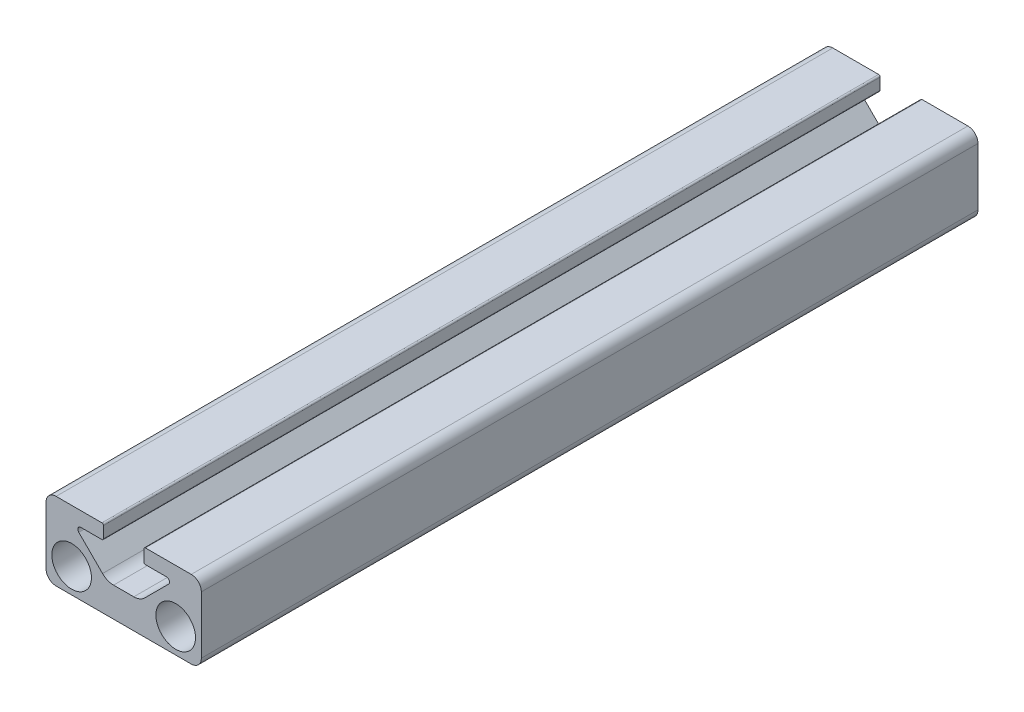
ISO-10303-21;
HEADER;
FILE_DESCRIPTION(('STEP AP214'),'2;1');
FILE_NAME('part.step','',(''),(''),'','','');
FILE_SCHEMA(('AUTOMOTIVE_DESIGN { 1 0 10303 214 1 1 1 1 }'));
ENDSEC;
DATA;
#1=APPLICATION_CONTEXT('core data for automotive mechanical design processes');
#2=APPLICATION_PROTOCOL_DEFINITION('international standard','automotive_design',2000,#1);
#3=PRODUCT_CONTEXT('',#1,'mechanical');
#4=PRODUCT('Part','Part','',(#3));
#5=PRODUCT_RELATED_PRODUCT_CATEGORY('part','',(#4));
#6=PRODUCT_DEFINITION_FORMATION('','',#4);
#7=PRODUCT_DEFINITION_CONTEXT('part definition',#1,'design');
#8=PRODUCT_DEFINITION('design','',#6,#7);
#9=PRODUCT_DEFINITION_SHAPE('','',#8);
#10=(LENGTH_UNIT() NAMED_UNIT(*) SI_UNIT(.MILLI.,.METRE.));
#11=(NAMED_UNIT(*) PLANE_ANGLE_UNIT() SI_UNIT($,.RADIAN.));
#12=(NAMED_UNIT(*) SI_UNIT($,.STERADIAN.) SOLID_ANGLE_UNIT());
#13=UNCERTAINTY_MEASURE_WITH_UNIT(LENGTH_MEASURE(1.E-05),#10,'distance_accuracy_value','');
#14=(GEOMETRIC_REPRESENTATION_CONTEXT(3) GLOBAL_UNCERTAINTY_ASSIGNED_CONTEXT((#13)) GLOBAL_UNIT_ASSIGNED_CONTEXT((#10,
#11,#12)) REPRESENTATION_CONTEXT('',''));
#15=CARTESIAN_POINT('',(0.,0.,0.));
#16=DIRECTION('',(0.,0.,1.));
#17=DIRECTION('',(1.,0.,0.));
#18=AXIS2_PLACEMENT_3D('',#15,#16,#17);
#19=CARTESIAN_POINT('',(-11.049,11.049,63.5));
#20=DIRECTION('',(0.,0.,1.));
#21=DIRECTION('',(1.,0.,0.));
#22=AXIS2_PLACEMENT_3D('',#19,#20,#21);
#23=PLANE('',#22);
#24=CARTESIAN_POINT('',(8.509,4.064,63.5));
#25=DIRECTION('',(0.,0.,1.));
#26=DIRECTION('',(1.,0.,0.));
#27=AXIS2_PLACEMENT_3D('',#24,#25,#26);
#28=CIRCLE('',#27,3.2385);
#29=CARTESIAN_POINT('',(11.7475,4.064,63.5));
#30=VERTEX_POINT('',#29);
#31=EDGE_CURVE('E513',#30,#30,#28,.T.);
#32=ORIENTED_EDGE('',*,*,#31,.F.);
#33=EDGE_LOOP('',(#32));
#34=FACE_BOUND('',#33,.T.);
#35=DIRECTION('',(0.,-1.,0.));
#36=VECTOR('',#35,1.);
#37=CARTESIAN_POINT('',(3.302,12.7,63.5));
#38=LINE('',#37,#36);
#39=CARTESIAN_POINT('',(3.302,12.446,63.5));
#40=VERTEX_POINT('',#39);
#41=CARTESIAN_POINT('',(3.302,10.582863886556,63.5));
#42=VERTEX_POINT('',#41);
#43=EDGE_CURVE('E480',#40,#42,#38,.T.);
#44=ORIENTED_EDGE('',*,*,#43,.T.);
#45=CARTESIAN_POINT('',(3.556,10.582863886556,63.5));
#46=DIRECTION('',(0.,0.,1.));
#47=DIRECTION('',(1.,0.,0.));
#48=AXIS2_PLACEMENT_3D('',#45,#46,#47);
#49=CIRCLE('',#48,0.254);
#50=CARTESIAN_POINT('',(3.556,10.328863886556,63.5));
#51=VERTEX_POINT('',#50);
#52=EDGE_CURVE('E269',#42,#51,#49,.T.);
#53=ORIENTED_EDGE('',*,*,#52,.T.);
#54=DIRECTION('',(1.,0.,0.));
#55=VECTOR('',#54,1.);
#56=CARTESIAN_POINT('',(3.302,10.328863886556,63.5));
#57=LINE('',#56,#55);
#58=CARTESIAN_POINT('',(6.985,10.328863886556,63.5));
#59=VERTEX_POINT('',#58);
#60=EDGE_CURVE('E472',#51,#59,#57,.T.);
#61=ORIENTED_EDGE('',*,*,#60,.T.);
#62=CARTESIAN_POINT('',(6.985,9.82086388655604,63.5));
#63=DIRECTION('',(0.,0.,-1.));
#64=DIRECTION('',(1.,0.,0.));
#65=AXIS2_PLACEMENT_3D('',#62,#63,#64);
#66=CIRCLE('',#65,0.508);
#67=CARTESIAN_POINT('',(7.34421024484277,9.46165364171327,63.5));
#68=VERTEX_POINT('',#67);
#69=EDGE_CURVE('E465',#59,#68,#66,.T.);
#70=ORIENTED_EDGE('',*,*,#69,.T.);
#71=DIRECTION('',(-0.707106781186546,-0.707106781186549,0.));
#72=VECTOR('',#71,1.);
#73=CARTESIAN_POINT('',(7.34421024484277,9.46165364171327,63.5));
#74=LINE('',#73,#72);
#75=CARTESIAN_POINT('',(3.45250537891568,5.56994877578617,63.5));
#76=VERTEX_POINT('',#75);
#77=EDGE_CURVE('E460',#68,#76,#74,.T.);
#78=ORIENTED_EDGE('',*,*,#77,.T.);
#79=CARTESIAN_POINT('',(1.65645415470184,7.366,63.5));
#80=DIRECTION('',(0.,0.,-1.));
#81=DIRECTION('',(1.,0.,0.));
#82=AXIS2_PLACEMENT_3D('',#79,#80,#81);
#83=CIRCLE('',#82,2.54);
#84=CARTESIAN_POINT('',(1.65645415470184,4.826,63.5));
#85=VERTEX_POINT('',#84);
#86=EDGE_CURVE('E456',#76,#85,#83,.T.);
#87=ORIENTED_EDGE('',*,*,#86,.T.);
#88=DIRECTION('',(-1.,0.,0.));
#89=VECTOR('',#88,1.);
#90=CARTESIAN_POINT('',(1.65645415470184,4.826,63.5));
#91=LINE('',#90,#89);
#92=CARTESIAN_POINT('',(-1.65645415470184,4.826,63.5));
#93=VERTEX_POINT('',#92);
#94=EDGE_CURVE('E447',#85,#93,#91,.T.);
#95=ORIENTED_EDGE('',*,*,#94,.T.);
#96=CARTESIAN_POINT('',(-1.65645415470184,7.366,63.5));
#97=DIRECTION('',(0.,0.,-1.));
#98=DIRECTION('',(1.,0.,0.));
#99=AXIS2_PLACEMENT_3D('',#96,#97,#98);
#100=CIRCLE('',#99,2.54);
#101=CARTESIAN_POINT('',(-3.45250537891568,5.56994877578617,63.5));
#102=VERTEX_POINT('',#101);
#103=EDGE_CURVE('E442',#93,#102,#100,.T.);
#104=ORIENTED_EDGE('',*,*,#103,.T.);
#105=DIRECTION('',(-0.707106781186546,0.707106781186549,0.));
#106=VECTOR('',#105,1.);
#107=CARTESIAN_POINT('',(-3.45250537891568,5.56994877578617,63.5));
#108=LINE('',#107,#106);
#109=CARTESIAN_POINT('',(-7.34421024484277,9.46165364171327,63.5));
#110=VERTEX_POINT('',#109);
#111=EDGE_CURVE('E438',#102,#110,#108,.T.);
#112=ORIENTED_EDGE('',*,*,#111,.T.);
#113=CARTESIAN_POINT('',(-6.985,9.82086388655604,63.5));
#114=DIRECTION('',(0.,0.,-1.));
#115=DIRECTION('',(1.,0.,0.));
#116=AXIS2_PLACEMENT_3D('',#113,#114,#115);
#117=CIRCLE('',#116,0.507999999999999);
#118=CARTESIAN_POINT('',(-6.985,10.328863886556,63.5));
#119=VERTEX_POINT('',#118);
#120=EDGE_CURVE('E294',#110,#119,#117,.T.);
#121=ORIENTED_EDGE('',*,*,#120,.T.);
#122=DIRECTION('',(1.,0.,0.));
#123=VECTOR('',#122,1.);
#124=CARTESIAN_POINT('',(-6.985,10.328863886556,63.5));
#125=LINE('',#124,#123);
#126=CARTESIAN_POINT('',(-3.556,10.328863886556,63.5));
#127=VERTEX_POINT('',#126);
#128=EDGE_CURVE('E288',#119,#127,#125,.T.);
#129=ORIENTED_EDGE('',*,*,#128,.T.);
#130=CARTESIAN_POINT('',(-3.556,10.582863886556,63.5));
#131=DIRECTION('',(0.,0.,1.));
#132=DIRECTION('',(1.,0.,0.));
#133=AXIS2_PLACEMENT_3D('',#130,#131,#132);
#134=CIRCLE('',#133,0.254);
#135=CARTESIAN_POINT('',(-3.302,10.582863886556,63.5));
#136=VERTEX_POINT('',#135);
#137=EDGE_CURVE('E263',#127,#136,#134,.T.);
#138=ORIENTED_EDGE('',*,*,#137,.T.);
#139=DIRECTION('',(0.,1.,0.));
#140=VECTOR('',#139,1.);
#141=CARTESIAN_POINT('',(-3.302,12.7,63.5));
#142=LINE('',#141,#140);
#143=CARTESIAN_POINT('',(-3.302,12.446,63.5));
#144=VERTEX_POINT('',#143);
#145=EDGE_CURVE('E297',#136,#144,#142,.T.);
#146=ORIENTED_EDGE('',*,*,#145,.T.);
#147=CARTESIAN_POINT('',(-3.556,12.446,63.5));
#148=DIRECTION('',(0.,0.,1.));
#149=DIRECTION('',(1.,0.,0.));
#150=AXIS2_PLACEMENT_3D('',#147,#148,#149);
#151=CIRCLE('',#150,0.254);
#152=CARTESIAN_POINT('',(-3.556,12.7,63.5));
#153=VERTEX_POINT('',#152);
#154=EDGE_CURVE('E57',#144,#153,#151,.T.);
#155=ORIENTED_EDGE('',*,*,#154,.T.);
#156=DIRECTION('',(-1.,0.,0.));
#157=VECTOR('',#156,1.);
#158=CARTESIAN_POINT('',(-11.049,12.7,63.5));
#159=LINE('',#158,#157);
#160=CARTESIAN_POINT('',(-11.049,12.7,63.5));
#161=VERTEX_POINT('',#160);
#162=EDGE_CURVE('E221',#153,#161,#159,.T.);
#163=ORIENTED_EDGE('',*,*,#162,.T.);
#164=CARTESIAN_POINT('',(-11.049,11.049,63.5));
#165=DIRECTION('',(0.,0.,1.));
#166=DIRECTION('',(1.,0.,0.));
#167=AXIS2_PLACEMENT_3D('',#164,#165,#166);
#168=CIRCLE('',#167,1.651);
#169=CARTESIAN_POINT('',(-12.7,11.049,63.5));
#170=VERTEX_POINT('',#169);
#171=EDGE_CURVE('E216',#161,#170,#168,.T.);
#172=ORIENTED_EDGE('',*,*,#171,.T.);
#173=DIRECTION('',(0.,-1.,0.));
#174=VECTOR('',#173,1.);
#175=CARTESIAN_POINT('',(-12.7,11.049,63.5));
#176=LINE('',#175,#174);
#177=CARTESIAN_POINT('',(-12.7,1.65099999999999,63.5));
#178=VERTEX_POINT('',#177);
#179=EDGE_CURVE('E205',#170,#178,#176,.T.);
#180=ORIENTED_EDGE('',*,*,#179,.T.);
#181=CARTESIAN_POINT('',(-11.049,1.65099999999999,63.5));
#182=DIRECTION('',(0.,0.,1.));
#183=DIRECTION('',(1.,0.,0.));
#184=AXIS2_PLACEMENT_3D('',#181,#182,#183);
#185=CIRCLE('',#184,1.651);
#186=CARTESIAN_POINT('',(-11.049,0.,63.5));
#187=VERTEX_POINT('',#186);
#188=EDGE_CURVE('E215',#178,#187,#185,.T.);
#189=ORIENTED_EDGE('',*,*,#188,.T.);
#190=DIRECTION('',(1.,0.,0.));
#191=VECTOR('',#190,1.);
#192=CARTESIAN_POINT('',(11.049,0.,63.5));
#193=LINE('',#192,#191);
#194=CARTESIAN_POINT('',(11.049,0.,63.5));
#195=VERTEX_POINT('',#194);
#196=EDGE_CURVE('E376',#187,#195,#193,.T.);
#197=ORIENTED_EDGE('',*,*,#196,.T.);
#198=CARTESIAN_POINT('',(11.049,1.651,63.5));
#199=DIRECTION('',(0.,0.,1.));
#200=DIRECTION('',(1.,0.,0.));
#201=AXIS2_PLACEMENT_3D('',#198,#199,#200);
#202=CIRCLE('',#201,1.651);
#203=CARTESIAN_POINT('',(12.7,1.651,63.5));
#204=VERTEX_POINT('',#203);
#205=EDGE_CURVE('E519',#195,#204,#202,.T.);
#206=ORIENTED_EDGE('',*,*,#205,.T.);
#207=DIRECTION('',(0.,1.,0.));
#208=VECTOR('',#207,1.);
#209=CARTESIAN_POINT('',(12.7,1.651,63.5));
#210=LINE('',#209,#208);
#211=CARTESIAN_POINT('',(12.7,11.049,63.5));
#212=VERTEX_POINT('',#211);
#213=EDGE_CURVE('E524',#204,#212,#210,.T.);
#214=ORIENTED_EDGE('',*,*,#213,.T.);
#215=CARTESIAN_POINT('',(11.049,11.049,63.5));
#216=DIRECTION('',(0.,0.,1.));
#217=DIRECTION('',(1.,0.,0.));
#218=AXIS2_PLACEMENT_3D('',#215,#216,#217);
#219=CIRCLE('',#218,1.651);
#220=CARTESIAN_POINT('',(11.049,12.7,63.5));
#221=VERTEX_POINT('',#220);
#222=EDGE_CURVE('E490',#212,#221,#219,.T.);
#223=ORIENTED_EDGE('',*,*,#222,.T.);
#224=DIRECTION('',(-1.,0.,0.));
#225=VECTOR('',#224,1.);
#226=CARTESIAN_POINT('',(3.302,12.7,63.5));
#227=LINE('',#226,#225);
#228=CARTESIAN_POINT('',(3.556,12.7,63.5));
#229=VERTEX_POINT('',#228);
#230=EDGE_CURVE('E485',#221,#229,#227,.T.);
#231=ORIENTED_EDGE('',*,*,#230,.T.);
#232=CARTESIAN_POINT('',(3.556,12.446,63.5));
#233=DIRECTION('',(0.,0.,1.));
#234=DIRECTION('',(1.,0.,0.));
#235=AXIS2_PLACEMENT_3D('',#232,#233,#234);
#236=CIRCLE('',#235,0.254);
#237=EDGE_CURVE('E266',#229,#40,#236,.T.);
#238=ORIENTED_EDGE('',*,*,#237,.T.);
#239=EDGE_LOOP('',(#44,#53,#61,#70,#78,#87,#95,#104,#112,#121,#129,#138,#146,#155,#163,#172,
#180,#189,#197,#206,#214,#223,#231,#238));
#240=FACE_BOUND('',#239,.T.);
#241=CARTESIAN_POINT('',(-8.509,4.064,63.5));
#242=DIRECTION('',(0.,0.,1.));
#243=DIRECTION('',(1.,0.,0.));
#244=AXIS2_PLACEMENT_3D('',#241,#242,#243);
#245=CIRCLE('',#244,3.2385);
#246=CARTESIAN_POINT('',(-5.2705,4.064,63.5));
#247=VERTEX_POINT('',#246);
#248=EDGE_CURVE('E782',#247,#247,#245,.T.);
#249=ORIENTED_EDGE('',*,*,#248,.F.);
#250=EDGE_LOOP('',(#249));
#251=FACE_BOUND('',#250,.T.);
#252=ADVANCED_FACE('F41',(#34,#240,#251),#23,.T.);
#253=CARTESIAN_POINT('',(-11.049,11.049,-63.5));
#254=DIRECTION('',(0.,0.,1.));
#255=DIRECTION('',(1.,0.,0.));
#256=AXIS2_PLACEMENT_3D('',#253,#254,#255);
#257=PLANE('',#256);
#258=DIRECTION('',(1.,0.,0.));
#259=VECTOR('',#258,1.);
#260=CARTESIAN_POINT('',(3.302,10.328863886556,-63.5));
#261=LINE('',#260,#259);
#262=CARTESIAN_POINT('',(3.556,10.328863886556,-63.5));
#263=VERTEX_POINT('',#262);
#264=CARTESIAN_POINT('',(6.985,10.328863886556,-63.5));
#265=VERTEX_POINT('',#264);
#266=EDGE_CURVE('E406',#263,#265,#261,.T.);
#267=ORIENTED_EDGE('',*,*,#266,.F.);
#268=CARTESIAN_POINT('',(3.556,10.582863886556,-63.5));
#269=DIRECTION('',(0.,0.,1.));
#270=DIRECTION('',(1.,0.,0.));
#271=AXIS2_PLACEMENT_3D('',#268,#269,#270);
#272=CIRCLE('',#271,0.254);
#273=CARTESIAN_POINT('',(3.302,10.582863886556,-63.5));
#274=VERTEX_POINT('',#273);
#275=EDGE_CURVE('E251',#263,#274,#272,.F.);
#276=ORIENTED_EDGE('',*,*,#275,.T.);
#277=DIRECTION('',(0.,-1.,0.));
#278=VECTOR('',#277,1.);
#279=CARTESIAN_POINT('',(3.302,12.7,-63.5));
#280=LINE('',#279,#278);
#281=CARTESIAN_POINT('',(3.302,12.446,-63.5));
#282=VERTEX_POINT('',#281);
#283=EDGE_CURVE('E402',#282,#274,#280,.T.);
#284=ORIENTED_EDGE('',*,*,#283,.F.);
#285=CARTESIAN_POINT('',(3.556,12.446,-63.5));
#286=DIRECTION('',(0.,0.,1.));
#287=DIRECTION('',(1.,0.,0.));
#288=AXIS2_PLACEMENT_3D('',#285,#286,#287);
#289=CIRCLE('',#288,0.254);
#290=CARTESIAN_POINT('',(3.556,12.7,-63.5));
#291=VERTEX_POINT('',#290);
#292=EDGE_CURVE('E248',#282,#291,#289,.F.);
#293=ORIENTED_EDGE('',*,*,#292,.T.);
#294=DIRECTION('',(-1.,0.,0.));
#295=VECTOR('',#294,1.);
#296=CARTESIAN_POINT('',(3.302,12.7,-63.5));
#297=LINE('',#296,#295);
#298=CARTESIAN_POINT('',(11.049,12.7,-63.5));
#299=VERTEX_POINT('',#298);
#300=EDGE_CURVE('E398',#299,#291,#297,.T.);
#301=ORIENTED_EDGE('',*,*,#300,.F.);
#302=CARTESIAN_POINT('',(11.049,11.049,-63.5));
#303=DIRECTION('',(0.,0.,1.));
#304=DIRECTION('',(1.,0.,0.));
#305=AXIS2_PLACEMENT_3D('',#302,#303,#304);
#306=CIRCLE('',#305,1.651);
#307=CARTESIAN_POINT('',(12.7,11.049,-63.5));
#308=VERTEX_POINT('',#307);
#309=EDGE_CURVE('E395',#308,#299,#306,.T.);
#310=ORIENTED_EDGE('',*,*,#309,.F.);
#311=DIRECTION('',(0.,1.,0.));
#312=VECTOR('',#311,1.);
#313=CARTESIAN_POINT('',(12.7,1.651,-63.5));
#314=LINE('',#313,#312);
#315=CARTESIAN_POINT('',(12.7,1.651,-63.5));
#316=VERTEX_POINT('',#315);
#317=EDGE_CURVE('E387',#316,#308,#314,.T.);
#318=ORIENTED_EDGE('',*,*,#317,.F.);
#319=CARTESIAN_POINT('',(11.049,1.651,-63.5));
#320=DIRECTION('',(0.,0.,1.));
#321=DIRECTION('',(1.,0.,0.));
#322=AXIS2_PLACEMENT_3D('',#319,#320,#321);
#323=CIRCLE('',#322,1.651);
#324=CARTESIAN_POINT('',(11.049,0.,-63.5));
#325=VERTEX_POINT('',#324);
#326=EDGE_CURVE('E382',#325,#316,#323,.T.);
#327=ORIENTED_EDGE('',*,*,#326,.F.);
#328=DIRECTION('',(1.,0.,0.));
#329=VECTOR('',#328,1.);
#330=CARTESIAN_POINT('',(11.049,0.,-63.5));
#331=LINE('',#330,#329);
#332=CARTESIAN_POINT('',(-11.049,0.,-63.5));
#333=VERTEX_POINT('',#332);
#334=EDGE_CURVE('E375',#333,#325,#331,.T.);
#335=ORIENTED_EDGE('',*,*,#334,.F.);
#336=CARTESIAN_POINT('',(-11.049,1.65099999999999,-63.5));
#337=DIRECTION('',(0.,0.,1.));
#338=DIRECTION('',(1.,0.,0.));
#339=AXIS2_PLACEMENT_3D('',#336,#337,#338);
#340=CIRCLE('',#339,1.651);
#341=CARTESIAN_POINT('',(-12.7,1.65099999999999,-63.5));
#342=VERTEX_POINT('',#341);
#343=EDGE_CURVE('E380',#342,#333,#340,.T.);
#344=ORIENTED_EDGE('',*,*,#343,.F.);
#345=DIRECTION('',(0.,-1.,0.));
#346=VECTOR('',#345,1.);
#347=CARTESIAN_POINT('',(-12.7,11.049,-63.5));
#348=LINE('',#347,#346);
#349=CARTESIAN_POINT('',(-12.7,11.049,-63.5));
#350=VERTEX_POINT('',#349);
#351=EDGE_CURVE('E389',#350,#342,#348,.T.);
#352=ORIENTED_EDGE('',*,*,#351,.F.);
#353=CARTESIAN_POINT('',(-11.049,11.049,-63.5));
#354=DIRECTION('',(0.,0.,1.));
#355=DIRECTION('',(1.,0.,0.));
#356=AXIS2_PLACEMENT_3D('',#353,#354,#355);
#357=CIRCLE('',#356,1.651);
#358=CARTESIAN_POINT('',(-11.049,12.7,-63.5));
#359=VERTEX_POINT('',#358);
#360=EDGE_CURVE('E230',#359,#350,#357,.T.);
#361=ORIENTED_EDGE('',*,*,#360,.F.);
#362=DIRECTION('',(-1.,0.,0.));
#363=VECTOR('',#362,1.);
#364=CARTESIAN_POINT('',(-11.049,12.7,-63.5));
#365=LINE('',#364,#363);
#366=CARTESIAN_POINT('',(-3.556,12.7,-63.5));
#367=VERTEX_POINT('',#366);
#368=EDGE_CURVE('E226',#367,#359,#365,.T.);
#369=ORIENTED_EDGE('',*,*,#368,.F.);
#370=CARTESIAN_POINT('',(-3.556,12.446,-63.5));
#371=DIRECTION('',(0.,0.,1.));
#372=DIRECTION('',(1.,0.,0.));
#373=AXIS2_PLACEMENT_3D('',#370,#371,#372);
#374=CIRCLE('',#373,0.254);
#375=CARTESIAN_POINT('',(-3.302,12.446,-63.5));
#376=VERTEX_POINT('',#375);
#377=EDGE_CURVE('E237',#367,#376,#374,.F.);
#378=ORIENTED_EDGE('',*,*,#377,.T.);
#379=DIRECTION('',(0.,1.,0.));
#380=VECTOR('',#379,1.);
#381=CARTESIAN_POINT('',(-3.302,12.7,-63.5));
#382=LINE('',#381,#380);
#383=CARTESIAN_POINT('',(-3.302,10.582863886556,-63.5));
#384=VERTEX_POINT('',#383);
#385=EDGE_CURVE('E303',#384,#376,#382,.T.);
#386=ORIENTED_EDGE('',*,*,#385,.F.);
#387=CARTESIAN_POINT('',(-3.556,10.582863886556,-63.5));
#388=DIRECTION('',(0.,0.,1.));
#389=DIRECTION('',(1.,0.,0.));
#390=AXIS2_PLACEMENT_3D('',#387,#388,#389);
#391=CIRCLE('',#390,0.254);
#392=CARTESIAN_POINT('',(-3.556,10.328863886556,-63.5));
#393=VERTEX_POINT('',#392);
#394=EDGE_CURVE('E245',#384,#393,#391,.F.);
#395=ORIENTED_EDGE('',*,*,#394,.T.);
#396=DIRECTION('',(1.,0.,0.));
#397=VECTOR('',#396,1.);
#398=CARTESIAN_POINT('',(-6.985,10.328863886556,-63.5));
#399=LINE('',#398,#397);
#400=CARTESIAN_POINT('',(-6.985,10.328863886556,-63.5));
#401=VERTEX_POINT('',#400);
#402=EDGE_CURVE('E290',#401,#393,#399,.T.);
#403=ORIENTED_EDGE('',*,*,#402,.F.);
#404=CARTESIAN_POINT('',(-6.985,9.82086388655604,-63.5));
#405=DIRECTION('',(0.,0.,-1.));
#406=DIRECTION('',(1.,0.,0.));
#407=AXIS2_PLACEMENT_3D('',#404,#405,#406);
#408=CIRCLE('',#407,0.507999999999999);
#409=CARTESIAN_POINT('',(-7.34421024484277,9.46165364171327,-63.5));
#410=VERTEX_POINT('',#409);
#411=EDGE_CURVE('E314',#410,#401,#408,.T.);
#412=ORIENTED_EDGE('',*,*,#411,.F.);
#413=DIRECTION('',(-0.707106781186546,0.707106781186549,0.));
#414=VECTOR('',#413,1.);
#415=CARTESIAN_POINT('',(-3.45250537891568,5.56994877578617,-63.5));
#416=LINE('',#415,#414);
#417=CARTESIAN_POINT('',(-3.45250537891568,5.56994877578617,-63.5));
#418=VERTEX_POINT('',#417);
#419=EDGE_CURVE('E424',#418,#410,#416,.T.);
#420=ORIENTED_EDGE('',*,*,#419,.F.);
#421=CARTESIAN_POINT('',(-1.65645415470184,7.366,-63.5));
#422=DIRECTION('',(0.,0.,-1.));
#423=DIRECTION('',(1.,0.,0.));
#424=AXIS2_PLACEMENT_3D('',#421,#422,#423);
#425=CIRCLE('',#424,2.54);
#426=CARTESIAN_POINT('',(-1.65645415470184,4.826,-63.5));
#427=VERTEX_POINT('',#426);
#428=EDGE_CURVE('E421',#427,#418,#425,.T.);
#429=ORIENTED_EDGE('',*,*,#428,.F.);
#430=DIRECTION('',(-1.,0.,0.));
#431=VECTOR('',#430,1.);
#432=CARTESIAN_POINT('',(1.65645415470184,4.826,-63.5));
#433=LINE('',#432,#431);
#434=CARTESIAN_POINT('',(1.65645415470184,4.826,-63.5));
#435=VERTEX_POINT('',#434);
#436=EDGE_CURVE('E418',#435,#427,#433,.T.);
#437=ORIENTED_EDGE('',*,*,#436,.F.);
#438=CARTESIAN_POINT('',(1.65645415470184,7.366,-63.5));
#439=DIRECTION('',(0.,0.,-1.));
#440=DIRECTION('',(1.,0.,0.));
#441=AXIS2_PLACEMENT_3D('',#438,#439,#440);
#442=CIRCLE('',#441,2.54);
#443=CARTESIAN_POINT('',(3.45250537891568,5.56994877578617,-63.5));
#444=VERTEX_POINT('',#443);
#445=EDGE_CURVE('E415',#444,#435,#442,.T.);
#446=ORIENTED_EDGE('',*,*,#445,.F.);
#447=DIRECTION('',(-0.707106781186546,-0.707106781186549,0.));
#448=VECTOR('',#447,1.);
#449=CARTESIAN_POINT('',(7.34421024484277,9.46165364171327,-63.5));
#450=LINE('',#449,#448);
#451=CARTESIAN_POINT('',(7.34421024484277,9.46165364171327,-63.5));
#452=VERTEX_POINT('',#451);
#453=EDGE_CURVE('E412',#452,#444,#450,.T.);
#454=ORIENTED_EDGE('',*,*,#453,.F.);
#455=CARTESIAN_POINT('',(6.985,9.82086388655604,-63.5));
#456=DIRECTION('',(0.,0.,-1.));
#457=DIRECTION('',(1.,0.,0.));
#458=AXIS2_PLACEMENT_3D('',#455,#456,#457);
#459=CIRCLE('',#458,0.508);
#460=EDGE_CURVE('E409',#265,#452,#459,.T.);
#461=ORIENTED_EDGE('',*,*,#460,.F.);
#462=EDGE_LOOP('',(#267,#276,#284,#293,#301,#310,#318,#327,#335,#344,#352,#361,#369,#378,#386,
#395,#403,#412,#420,#429,#437,#446,#454,#461));
#463=FACE_BOUND('',#462,.T.);
#464=CARTESIAN_POINT('',(8.509,4.064,-63.5));
#465=DIRECTION('',(0.,0.,1.));
#466=DIRECTION('',(1.,0.,0.));
#467=AXIS2_PLACEMENT_3D('',#464,#465,#466);
#468=CIRCLE('',#467,3.2385);
#469=CARTESIAN_POINT('',(11.7475,4.064,-63.5));
#470=VERTEX_POINT('',#469);
#471=EDGE_CURVE('E790',#470,#470,#468,.T.);
#472=ORIENTED_EDGE('',*,*,#471,.T.);
#473=EDGE_LOOP('',(#472));
#474=FACE_BOUND('',#473,.T.);
#475=CARTESIAN_POINT('',(-8.509,4.064,-63.5));
#476=DIRECTION('',(0.,0.,1.));
#477=DIRECTION('',(1.,0.,0.));
#478=AXIS2_PLACEMENT_3D('',#475,#476,#477);
#479=CIRCLE('',#478,3.2385);
#480=CARTESIAN_POINT('',(-5.2705,4.064,-63.5));
#481=VERTEX_POINT('',#480);
#482=EDGE_CURVE('E785',#481,#481,#479,.T.);
#483=ORIENTED_EDGE('',*,*,#482,.T.);
#484=EDGE_LOOP('',(#483));
#485=FACE_BOUND('',#484,.T.);
#486=ADVANCED_FACE('F306',(#463,#474,#485),#257,.F.);
#487=CARTESIAN_POINT('',(-11.049,11.049,63.5));
#488=DIRECTION('',(0.,0.,-1.));
#489=DIRECTION('',(-1.,0.,0.));
#490=AXIS2_PLACEMENT_3D('',#487,#488,#489);
#491=CYLINDRICAL_SURFACE('',#490,1.651);
#492=ORIENTED_EDGE('',*,*,#360,.T.);
#493=DIRECTION('',(0.,0.,-1.));
#494=VECTOR('',#493,1.);
#495=CARTESIAN_POINT('',(-12.7,11.049,63.5));
#496=LINE('',#495,#494);
#497=EDGE_CURVE('E209',#170,#350,#496,.T.);
#498=ORIENTED_EDGE('',*,*,#497,.F.);
#499=ORIENTED_EDGE('',*,*,#171,.F.);
#500=DIRECTION('',(0.,0.,-1.));
#501=VECTOR('',#500,1.);
#502=CARTESIAN_POINT('',(-11.049,12.7,63.5));
#503=LINE('',#502,#501);
#504=EDGE_CURVE('E318',#161,#359,#503,.T.);
#505=ORIENTED_EDGE('',*,*,#504,.T.);
#506=EDGE_LOOP('',(#492,#498,#499,#505));
#507=FACE_BOUND('',#506,.T.);
#508=ADVANCED_FACE('F228',(#507),#491,.T.);
#509=CARTESIAN_POINT('',(-12.7,11.049,63.5));
#510=DIRECTION('',(1.,0.,0.));
#511=DIRECTION('',(0.,0.,-1.));
#512=AXIS2_PLACEMENT_3D('',#509,#510,#511);
#513=PLANE('',#512);
#514=ORIENTED_EDGE('',*,*,#351,.T.);
#515=DIRECTION('',(0.,0.,-1.));
#516=VECTOR('',#515,1.);
#517=CARTESIAN_POINT('',(-12.7,1.65099999999999,63.5));
#518=LINE('',#517,#516);
#519=EDGE_CURVE('E212',#178,#342,#518,.T.);
#520=ORIENTED_EDGE('',*,*,#519,.F.);
#521=ORIENTED_EDGE('',*,*,#179,.F.);
#522=ORIENTED_EDGE('',*,*,#497,.T.);
#523=EDGE_LOOP('',(#514,#520,#521,#522));
#524=FACE_BOUND('',#523,.T.);
#525=ADVANCED_FACE('F207',(#524),#513,.F.);
#526=CARTESIAN_POINT('',(-11.049,1.65099999999999,63.5));
#527=DIRECTION('',(0.,0.,-1.));
#528=DIRECTION('',(-1.,0.,0.));
#529=AXIS2_PLACEMENT_3D('',#526,#527,#528);
#530=CYLINDRICAL_SURFACE('',#529,1.651);
#531=ORIENTED_EDGE('',*,*,#343,.T.);
#532=DIRECTION('',(0.,0.,-1.));
#533=VECTOR('',#532,1.);
#534=CARTESIAN_POINT('',(-11.049,0.,63.5));
#535=LINE('',#534,#533);
#536=EDGE_CURVE('E239',#187,#333,#535,.T.);
#537=ORIENTED_EDGE('',*,*,#536,.F.);
#538=ORIENTED_EDGE('',*,*,#188,.F.);
#539=ORIENTED_EDGE('',*,*,#519,.T.);
#540=EDGE_LOOP('',(#531,#537,#538,#539));
#541=FACE_BOUND('',#540,.T.);
#542=ADVANCED_FACE('F515',(#541),#530,.T.);
#543=CARTESIAN_POINT('',(11.049,0.,63.5));
#544=DIRECTION('',(0.,1.,0.));
#545=DIRECTION('',(-1.,0.,0.));
#546=AXIS2_PLACEMENT_3D('',#543,#544,#545);
#547=PLANE('',#546);
#548=ORIENTED_EDGE('',*,*,#334,.T.);
#549=DIRECTION('',(0.,0.,-1.));
#550=VECTOR('',#549,1.);
#551=CARTESIAN_POINT('',(11.049,0.,63.5));
#552=LINE('',#551,#550);
#553=EDGE_CURVE('E364',#195,#325,#552,.T.);
#554=ORIENTED_EDGE('',*,*,#553,.F.);
#555=ORIENTED_EDGE('',*,*,#196,.F.);
#556=ORIENTED_EDGE('',*,*,#536,.T.);
#557=EDGE_LOOP('',(#548,#554,#555,#556));
#558=FACE_BOUND('',#557,.T.);
#559=ADVANCED_FACE('F373',(#558),#547,.F.);
#560=CARTESIAN_POINT('',(11.049,1.651,63.5));
#561=DIRECTION('',(0.,0.,-1.));
#562=DIRECTION('',(-1.,0.,0.));
#563=AXIS2_PLACEMENT_3D('',#560,#561,#562);
#564=CYLINDRICAL_SURFACE('',#563,1.651);
#565=ORIENTED_EDGE('',*,*,#326,.T.);
#566=DIRECTION('',(0.,0.,-1.));
#567=VECTOR('',#566,1.);
#568=CARTESIAN_POINT('',(12.7,1.651,63.5));
#569=LINE('',#568,#567);
#570=EDGE_CURVE('E360',#204,#316,#569,.T.);
#571=ORIENTED_EDGE('',*,*,#570,.F.);
#572=ORIENTED_EDGE('',*,*,#205,.F.);
#573=ORIENTED_EDGE('',*,*,#553,.T.);
#574=EDGE_LOOP('',(#565,#571,#572,#573));
#575=FACE_BOUND('',#574,.T.);
#576=ADVANCED_FACE('F546',(#575),#564,.T.);
#577=CARTESIAN_POINT('',(12.7,1.651,63.5));
#578=DIRECTION('',(-1.,0.,0.));
#579=DIRECTION('',(0.,0.,1.));
#580=AXIS2_PLACEMENT_3D('',#577,#578,#579);
#581=PLANE('',#580);
#582=ORIENTED_EDGE('',*,*,#317,.T.);
#583=DIRECTION('',(0.,0.,-1.));
#584=VECTOR('',#583,1.);
#585=CARTESIAN_POINT('',(12.7,11.049,63.5));
#586=LINE('',#585,#584);
#587=EDGE_CURVE('E356',#212,#308,#586,.T.);
#588=ORIENTED_EDGE('',*,*,#587,.F.);
#589=ORIENTED_EDGE('',*,*,#213,.F.);
#590=ORIENTED_EDGE('',*,*,#570,.T.);
#591=EDGE_LOOP('',(#582,#588,#589,#590));
#592=FACE_BOUND('',#591,.T.);
#593=ADVANCED_FACE('F542',(#592),#581,.F.);
#594=CARTESIAN_POINT('',(11.049,11.049,63.5));
#595=DIRECTION('',(0.,0.,-1.));
#596=DIRECTION('',(-1.,0.,0.));
#597=AXIS2_PLACEMENT_3D('',#594,#595,#596);
#598=CYLINDRICAL_SURFACE('',#597,1.651);
#599=ORIENTED_EDGE('',*,*,#309,.T.);
#600=DIRECTION('',(0.,0.,-1.));
#601=VECTOR('',#600,1.);
#602=CARTESIAN_POINT('',(11.049,12.7,63.5));
#603=LINE('',#602,#601);
#604=EDGE_CURVE('E352',#221,#299,#603,.T.);
#605=ORIENTED_EDGE('',*,*,#604,.F.);
#606=ORIENTED_EDGE('',*,*,#222,.F.);
#607=ORIENTED_EDGE('',*,*,#587,.T.);
#608=EDGE_LOOP('',(#599,#605,#606,#607));
#609=FACE_BOUND('',#608,.T.);
#610=ADVANCED_FACE('F533',(#609),#598,.T.);
#611=CARTESIAN_POINT('',(3.302,12.7,63.5));
#612=DIRECTION('',(0.,-1.,0.));
#613=DIRECTION('',(1.,0.,0.));
#614=AXIS2_PLACEMENT_3D('',#611,#612,#613);
#615=PLANE('',#614);
#616=ORIENTED_EDGE('',*,*,#300,.T.);
#617=DIRECTION('',(0.,0.,-1.));
#618=VECTOR('',#617,1.);
#619=CARTESIAN_POINT('',(3.556,12.7,63.5));
#620=LINE('',#619,#618);
#621=EDGE_CURVE('E272',#291,#229,#620,.F.);
#622=ORIENTED_EDGE('',*,*,#621,.T.);
#623=ORIENTED_EDGE('',*,*,#230,.F.);
#624=ORIENTED_EDGE('',*,*,#604,.T.);
#625=EDGE_LOOP('',(#616,#622,#623,#624));
#626=FACE_BOUND('',#625,.T.);
#627=ADVANCED_FACE('F537',(#626),#615,.F.);
#628=CARTESIAN_POINT('',(3.302,12.7,63.5));
#629=DIRECTION('',(1.,0.,0.));
#630=DIRECTION('',(0.,1.,0.));
#631=AXIS2_PLACEMENT_3D('',#628,#629,#630);
#632=PLANE('',#631);
#633=ORIENTED_EDGE('',*,*,#283,.T.);
#634=DIRECTION('',(0.,0.,-1.));
#635=VECTOR('',#634,1.);
#636=CARTESIAN_POINT('',(3.302,10.582863886556,63.5));
#637=LINE('',#636,#635);
#638=EDGE_CURVE('E258',#274,#42,#637,.F.);
#639=ORIENTED_EDGE('',*,*,#638,.T.);
#640=ORIENTED_EDGE('',*,*,#43,.F.);
#641=DIRECTION('',(0.,0.,-1.));
#642=VECTOR('',#641,1.);
#643=CARTESIAN_POINT('',(3.302,12.446,63.5));
#644=LINE('',#643,#642);
#645=EDGE_CURVE('E254',#40,#282,#644,.T.);
#646=ORIENTED_EDGE('',*,*,#645,.T.);
#647=EDGE_LOOP('',(#633,#639,#640,#646));
#648=FACE_BOUND('',#647,.T.);
#649=ADVANCED_FACE('F479',(#648),#632,.F.);
#650=CARTESIAN_POINT('',(3.302,10.328863886556,63.5));
#651=DIRECTION('',(0.,1.,0.));
#652=DIRECTION('',(0.,0.,1.));
#653=AXIS2_PLACEMENT_3D('',#650,#651,#652);
#654=PLANE('',#653);
#655=ORIENTED_EDGE('',*,*,#60,.F.);
#656=DIRECTION('',(0.,0.,-1.));
#657=VECTOR('',#656,1.);
#658=CARTESIAN_POINT('',(3.556,10.328863886556,63.5));
#659=LINE('',#658,#657);
#660=EDGE_CURVE('E232',#51,#263,#659,.T.);
#661=ORIENTED_EDGE('',*,*,#660,.T.);
#662=ORIENTED_EDGE('',*,*,#266,.T.);
#663=DIRECTION('',(0.,0.,-1.));
#664=VECTOR('',#663,1.);
#665=CARTESIAN_POINT('',(6.985,10.328863886556,63.5));
#666=LINE('',#665,#664);
#667=EDGE_CURVE('E348',#59,#265,#666,.T.);
#668=ORIENTED_EDGE('',*,*,#667,.F.);
#669=EDGE_LOOP('',(#655,#661,#662,#668));
#670=FACE_BOUND('',#669,.T.);
#671=ADVANCED_FACE('F470',(#670),#654,.F.);
#672=CARTESIAN_POINT('',(6.985,9.82086388655604,63.5));
#673=DIRECTION('',(0.,0.,-1.));
#674=DIRECTION('',(-1.,0.,0.));
#675=AXIS2_PLACEMENT_3D('',#672,#673,#674);
#676=CYLINDRICAL_SURFACE('',#675,0.508);
#677=ORIENTED_EDGE('',*,*,#460,.T.);
#678=DIRECTION('',(0.,0.,-1.));
#679=VECTOR('',#678,1.);
#680=CARTESIAN_POINT('',(7.34421024484277,9.46165364171327,63.5));
#681=LINE('',#680,#679);
#682=EDGE_CURVE('E344',#68,#452,#681,.T.);
#683=ORIENTED_EDGE('',*,*,#682,.F.);
#684=ORIENTED_EDGE('',*,*,#69,.F.);
#685=ORIENTED_EDGE('',*,*,#667,.T.);
#686=EDGE_LOOP('',(#677,#683,#684,#685));
#687=FACE_BOUND('',#686,.T.);
#688=ADVANCED_FACE('F464',(#687),#676,.F.);
#689=CARTESIAN_POINT('',(7.34421024484277,9.46165364171327,63.5));
#690=DIRECTION('',(0.707106781186549,-0.707106781186546,0.));
#691=DIRECTION('',(0.707106781186546,0.707106781186549,0.));
#692=AXIS2_PLACEMENT_3D('',#689,#690,#691);
#693=PLANE('',#692);
#694=ORIENTED_EDGE('',*,*,#453,.T.);
#695=DIRECTION('',(0.,0.,-1.));
#696=VECTOR('',#695,1.);
#697=CARTESIAN_POINT('',(3.45250537891568,5.56994877578617,63.5));
#698=LINE('',#697,#696);
#699=EDGE_CURVE('E340',#76,#444,#698,.T.);
#700=ORIENTED_EDGE('',*,*,#699,.F.);
#701=ORIENTED_EDGE('',*,*,#77,.F.);
#702=ORIENTED_EDGE('',*,*,#682,.T.);
#703=EDGE_LOOP('',(#694,#700,#701,#702));
#704=FACE_BOUND('',#703,.T.);
#705=ADVANCED_FACE('F459',(#704),#693,.F.);
#706=CARTESIAN_POINT('',(1.65645415470184,7.366,63.5));
#707=DIRECTION('',(0.,0.,-1.));
#708=DIRECTION('',(-1.,0.,0.));
#709=AXIS2_PLACEMENT_3D('',#706,#707,#708);
#710=CYLINDRICAL_SURFACE('',#709,2.54);
#711=ORIENTED_EDGE('',*,*,#445,.T.);
#712=DIRECTION('',(0.,0.,-1.));
#713=VECTOR('',#712,1.);
#714=CARTESIAN_POINT('',(1.65645415470184,4.826,63.5));
#715=LINE('',#714,#713);
#716=EDGE_CURVE('E336',#85,#435,#715,.T.);
#717=ORIENTED_EDGE('',*,*,#716,.F.);
#718=ORIENTED_EDGE('',*,*,#86,.F.);
#719=ORIENTED_EDGE('',*,*,#699,.T.);
#720=EDGE_LOOP('',(#711,#717,#718,#719));
#721=FACE_BOUND('',#720,.T.);
#722=ADVANCED_FACE('F453',(#721),#710,.F.);
#723=CARTESIAN_POINT('',(1.65645415470184,4.826,63.5));
#724=DIRECTION('',(0.,-1.,0.));
#725=DIRECTION('',(1.,0.,0.));
#726=AXIS2_PLACEMENT_3D('',#723,#724,#725);
#727=PLANE('',#726);
#728=ORIENTED_EDGE('',*,*,#436,.T.);
#729=DIRECTION('',(0.,0.,-1.));
#730=VECTOR('',#729,1.);
#731=CARTESIAN_POINT('',(-1.65645415470184,4.826,63.5));
#732=LINE('',#731,#730);
#733=EDGE_CURVE('E332',#93,#427,#732,.T.);
#734=ORIENTED_EDGE('',*,*,#733,.F.);
#735=ORIENTED_EDGE('',*,*,#94,.F.);
#736=ORIENTED_EDGE('',*,*,#716,.T.);
#737=EDGE_LOOP('',(#728,#734,#735,#736));
#738=FACE_BOUND('',#737,.T.);
#739=ADVANCED_FACE('F446',(#738),#727,.F.);
#740=CARTESIAN_POINT('',(-1.65645415470184,7.366,63.5));
#741=DIRECTION('',(0.,0.,-1.));
#742=DIRECTION('',(-1.,0.,0.));
#743=AXIS2_PLACEMENT_3D('',#740,#741,#742);
#744=CYLINDRICAL_SURFACE('',#743,2.54);
#745=ORIENTED_EDGE('',*,*,#428,.T.);
#746=DIRECTION('',(0.,0.,-1.));
#747=VECTOR('',#746,1.);
#748=CARTESIAN_POINT('',(-3.45250537891568,5.56994877578617,63.5));
#749=LINE('',#748,#747);
#750=EDGE_CURVE('E328',#102,#418,#749,.T.);
#751=ORIENTED_EDGE('',*,*,#750,.F.);
#752=ORIENTED_EDGE('',*,*,#103,.F.);
#753=ORIENTED_EDGE('',*,*,#733,.T.);
#754=EDGE_LOOP('',(#745,#751,#752,#753));
#755=FACE_BOUND('',#754,.T.);
#756=ADVANCED_FACE('F441',(#755),#744,.F.);
#757=CARTESIAN_POINT('',(-3.45250537891568,5.56994877578617,63.5));
#758=DIRECTION('',(-0.707106781186549,-0.707106781186546,0.));
#759=DIRECTION('',(0.707106781186546,-0.707106781186549,0.));
#760=AXIS2_PLACEMENT_3D('',#757,#758,#759);
#761=PLANE('',#760);
#762=ORIENTED_EDGE('',*,*,#419,.T.);
#763=DIRECTION('',(0.,0.,-1.));
#764=VECTOR('',#763,1.);
#765=CARTESIAN_POINT('',(-7.34421024484277,9.46165364171327,63.5));
#766=LINE('',#765,#764);
#767=EDGE_CURVE('E324',#110,#410,#766,.T.);
#768=ORIENTED_EDGE('',*,*,#767,.F.);
#769=ORIENTED_EDGE('',*,*,#111,.F.);
#770=ORIENTED_EDGE('',*,*,#750,.T.);
#771=EDGE_LOOP('',(#762,#768,#769,#770));
#772=FACE_BOUND('',#771,.T.);
#773=ADVANCED_FACE('F435',(#772),#761,.F.);
#774=CARTESIAN_POINT('',(-6.985,9.82086388655604,63.5));
#775=DIRECTION('',(0.,0.,-1.));
#776=DIRECTION('',(-1.,0.,0.));
#777=AXIS2_PLACEMENT_3D('',#774,#775,#776);
#778=CYLINDRICAL_SURFACE('',#777,0.507999999999999);
#779=ORIENTED_EDGE('',*,*,#411,.T.);
#780=DIRECTION('',(0.,0.,-1.));
#781=VECTOR('',#780,1.);
#782=CARTESIAN_POINT('',(-6.985,10.328863886556,63.5));
#783=LINE('',#782,#781);
#784=EDGE_CURVE('E321',#119,#401,#783,.T.);
#785=ORIENTED_EDGE('',*,*,#784,.F.);
#786=ORIENTED_EDGE('',*,*,#120,.F.);
#787=ORIENTED_EDGE('',*,*,#767,.T.);
#788=EDGE_LOOP('',(#779,#785,#786,#787));
#789=FACE_BOUND('',#788,.T.);
#790=ADVANCED_FACE('F429',(#789),#778,.F.);
#791=CARTESIAN_POINT('',(-6.985,10.328863886556,63.5));
#792=DIRECTION('',(0.,1.,0.));
#793=DIRECTION('',(-1.,0.,0.));
#794=AXIS2_PLACEMENT_3D('',#791,#792,#793);
#795=PLANE('',#794);
#796=ORIENTED_EDGE('',*,*,#402,.T.);
#797=DIRECTION('',(0.,0.,-1.));
#798=VECTOR('',#797,1.);
#799=CARTESIAN_POINT('',(-3.556,10.328863886556,63.5));
#800=LINE('',#799,#798);
#801=EDGE_CURVE('E50',#393,#127,#800,.F.);
#802=ORIENTED_EDGE('',*,*,#801,.T.);
#803=ORIENTED_EDGE('',*,*,#128,.F.);
#804=ORIENTED_EDGE('',*,*,#784,.T.);
#805=EDGE_LOOP('',(#796,#802,#803,#804));
#806=FACE_BOUND('',#805,.T.);
#807=ADVANCED_FACE('F286',(#806),#795,.F.);
#808=CARTESIAN_POINT('',(-3.302,12.7,63.5));
#809=DIRECTION('',(-1.,0.,0.));
#810=DIRECTION('',(0.,-1.,0.));
#811=AXIS2_PLACEMENT_3D('',#808,#809,#810);
#812=PLANE('',#811);
#813=ORIENTED_EDGE('',*,*,#145,.F.);
#814=DIRECTION('',(0.,0.,-1.));
#815=VECTOR('',#814,1.);
#816=CARTESIAN_POINT('',(-3.302,10.582863886556,63.5));
#817=LINE('',#816,#815);
#818=EDGE_CURVE('E277',#136,#384,#817,.T.);
#819=ORIENTED_EDGE('',*,*,#818,.T.);
#820=ORIENTED_EDGE('',*,*,#385,.T.);
#821=DIRECTION('',(0.,0.,-1.));
#822=VECTOR('',#821,1.);
#823=CARTESIAN_POINT('',(-3.302,12.446,63.5));
#824=LINE('',#823,#822);
#825=EDGE_CURVE('E65',#376,#144,#824,.F.);
#826=ORIENTED_EDGE('',*,*,#825,.T.);
#827=EDGE_LOOP('',(#813,#819,#820,#826));
#828=FACE_BOUND('',#827,.T.);
#829=ADVANCED_FACE('F302',(#828),#812,.F.);
#830=CARTESIAN_POINT('',(-11.049,12.7,63.5));
#831=DIRECTION('',(0.,-1.,0.));
#832=DIRECTION('',(1.,0.,0.));
#833=AXIS2_PLACEMENT_3D('',#830,#831,#832);
#834=PLANE('',#833);
#835=ORIENTED_EDGE('',*,*,#162,.F.);
#836=DIRECTION('',(0.,0.,-1.));
#837=VECTOR('',#836,1.);
#838=CARTESIAN_POINT('',(-3.556,12.7,63.5));
#839=LINE('',#838,#837);
#840=EDGE_CURVE('E11',#153,#367,#839,.T.);
#841=ORIENTED_EDGE('',*,*,#840,.T.);
#842=ORIENTED_EDGE('',*,*,#368,.T.);
#843=ORIENTED_EDGE('',*,*,#504,.F.);
#844=EDGE_LOOP('',(#835,#841,#842,#843));
#845=FACE_BOUND('',#844,.T.);
#846=ADVANCED_FACE('F567',(#845),#834,.F.);
#847=CARTESIAN_POINT('',(8.509,4.064,63.5));
#848=DIRECTION('',(0.,0.,-1.));
#849=DIRECTION('',(-1.,0.,0.));
#850=AXIS2_PLACEMENT_3D('',#847,#848,#849);
#851=CYLINDRICAL_SURFACE('',#850,3.2385);
#852=ORIENTED_EDGE('',*,*,#31,.T.);
#853=EDGE_LOOP('',(#852));
#854=FACE_BOUND('',#853,.T.);
#855=ORIENTED_EDGE('',*,*,#471,.F.);
#856=EDGE_LOOP('',(#855));
#857=FACE_BOUND('',#856,.T.);
#858=ADVANCED_FACE('F564',(#854,#857),#851,.F.);
#859=CARTESIAN_POINT('',(-8.509,4.064,63.5));
#860=DIRECTION('',(0.,0.,-1.));
#861=DIRECTION('',(-1.,0.,0.));
#862=AXIS2_PLACEMENT_3D('',#859,#860,#861);
#863=CYLINDRICAL_SURFACE('',#862,3.2385);
#864=ORIENTED_EDGE('',*,*,#248,.T.);
#865=EDGE_LOOP('',(#864));
#866=FACE_BOUND('',#865,.T.);
#867=ORIENTED_EDGE('',*,*,#482,.F.);
#868=EDGE_LOOP('',(#867));
#869=FACE_BOUND('',#868,.T.);
#870=ADVANCED_FACE('F660',(#866,#869),#863,.F.);
#871=CARTESIAN_POINT('',(3.556,10.582863886556,63.5));
#872=DIRECTION('',(0.,0.,-1.));
#873=DIRECTION('',(-1.,0.,0.));
#874=AXIS2_PLACEMENT_3D('',#871,#872,#873);
#875=CYLINDRICAL_SURFACE('',#874,0.254);
#876=ORIENTED_EDGE('',*,*,#52,.F.);
#877=ORIENTED_EDGE('',*,*,#638,.F.);
#878=ORIENTED_EDGE('',*,*,#275,.F.);
#879=ORIENTED_EDGE('',*,*,#660,.F.);
#880=EDGE_LOOP('',(#876,#877,#878,#879));
#881=FACE_BOUND('',#880,.T.);
#882=ADVANCED_FACE('F475',(#881),#875,.T.);
#883=CARTESIAN_POINT('',(3.556,12.446,63.5));
#884=DIRECTION('',(0.,0.,-1.));
#885=DIRECTION('',(-1.,0.,0.));
#886=AXIS2_PLACEMENT_3D('',#883,#884,#885);
#887=CYLINDRICAL_SURFACE('',#886,0.254);
#888=ORIENTED_EDGE('',*,*,#237,.F.);
#889=ORIENTED_EDGE('',*,*,#621,.F.);
#890=ORIENTED_EDGE('',*,*,#292,.F.);
#891=ORIENTED_EDGE('',*,*,#645,.F.);
#892=EDGE_LOOP('',(#888,#889,#890,#891));
#893=FACE_BOUND('',#892,.T.);
#894=ADVANCED_FACE('F540',(#893),#887,.T.);
#895=CARTESIAN_POINT('',(-3.556,10.582863886556,63.5));
#896=DIRECTION('',(0.,0.,-1.));
#897=DIRECTION('',(-1.,0.,0.));
#898=AXIS2_PLACEMENT_3D('',#895,#896,#897);
#899=CYLINDRICAL_SURFACE('',#898,0.254);
#900=ORIENTED_EDGE('',*,*,#137,.F.);
#901=ORIENTED_EDGE('',*,*,#801,.F.);
#902=ORIENTED_EDGE('',*,*,#394,.F.);
#903=ORIENTED_EDGE('',*,*,#818,.F.);
#904=EDGE_LOOP('',(#900,#901,#902,#903));
#905=FACE_BOUND('',#904,.T.);
#906=ADVANCED_FACE('F300',(#905),#899,.T.);
#907=CARTESIAN_POINT('',(-3.556,12.446,63.5));
#908=DIRECTION('',(0.,0.,-1.));
#909=DIRECTION('',(-1.,0.,0.));
#910=AXIS2_PLACEMENT_3D('',#907,#908,#909);
#911=CYLINDRICAL_SURFACE('',#910,0.254);
#912=ORIENTED_EDGE('',*,*,#154,.F.);
#913=ORIENTED_EDGE('',*,*,#825,.F.);
#914=ORIENTED_EDGE('',*,*,#377,.F.);
#915=ORIENTED_EDGE('',*,*,#840,.F.);
#916=EDGE_LOOP('',(#912,#913,#914,#915));
#917=FACE_BOUND('',#916,.T.);
#918=ADVANCED_FACE('F43',(#917),#911,.T.);
#919=CLOSED_SHELL('',(#252,#486,#508,#525,#542,#559,#576,#593,#610,#627,#649,#671,#688,#705,
#722,#739,#756,#773,#790,#807,#829,#846,#858,#870,#882,#894,#906,#918));
#920=MANIFOLD_SOLID_BREP('B2',#919);
#921=ADVANCED_BREP_SHAPE_REPRESENTATION('',(#18,#920),#14);
#922=SHAPE_DEFINITION_REPRESENTATION(#9,#921);
ENDSEC;
END-ISO-10303-21;
